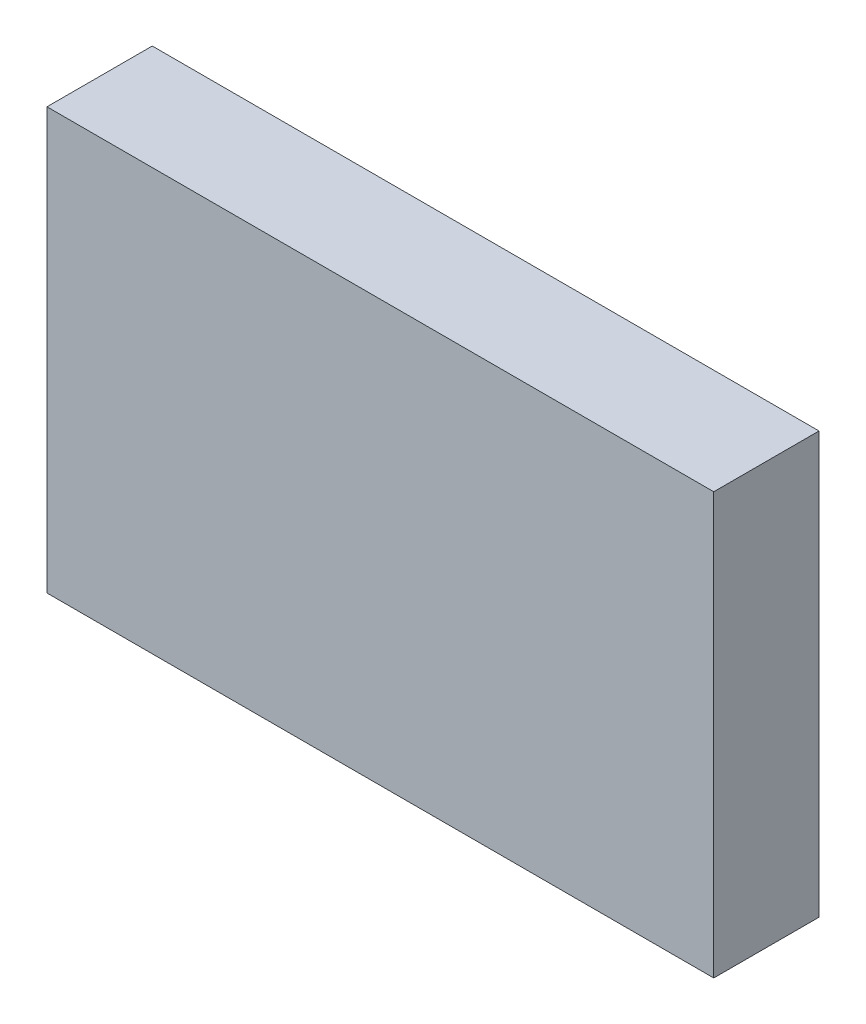
ISO-10303-21;
HEADER;
FILE_DESCRIPTION(('STEP AP214'),'2;1');
FILE_NAME('part.step','',(''),(''),'','','');
FILE_SCHEMA(('AUTOMOTIVE_DESIGN { 1 0 10303 214 1 1 1 1 }'));
ENDSEC;
DATA;
#1=APPLICATION_CONTEXT('core data for automotive mechanical design processes');
#2=APPLICATION_PROTOCOL_DEFINITION('international standard','automotive_design',2000,#1);
#3=PRODUCT_CONTEXT('',#1,'mechanical');
#4=PRODUCT('Part','Part','',(#3));
#5=PRODUCT_RELATED_PRODUCT_CATEGORY('part','',(#4));
#6=PRODUCT_DEFINITION_FORMATION('','',#4);
#7=PRODUCT_DEFINITION_CONTEXT('part definition',#1,'design');
#8=PRODUCT_DEFINITION('design','',#6,#7);
#9=PRODUCT_DEFINITION_SHAPE('','',#8);
#10=(LENGTH_UNIT() NAMED_UNIT(*) SI_UNIT(.MILLI.,.METRE.));
#11=(NAMED_UNIT(*) PLANE_ANGLE_UNIT() SI_UNIT($,.RADIAN.));
#12=(NAMED_UNIT(*) SI_UNIT($,.STERADIAN.) SOLID_ANGLE_UNIT());
#13=UNCERTAINTY_MEASURE_WITH_UNIT(LENGTH_MEASURE(1.E-05),#10,'distance_accuracy_value','');
#14=(GEOMETRIC_REPRESENTATION_CONTEXT(3) GLOBAL_UNCERTAINTY_ASSIGNED_CONTEXT((#13)) GLOBAL_UNIT_ASSIGNED_CONTEXT((#10,
#11,#12)) REPRESENTATION_CONTEXT('',''));
#15=CARTESIAN_POINT('',(0.,0.,0.));
#16=DIRECTION('',(0.,0.,1.));
#17=DIRECTION('',(1.,0.,0.));
#18=AXIS2_PLACEMENT_3D('',#15,#16,#17);
#19=CARTESIAN_POINT('',(-47.5,-30.,15.));
#20=DIRECTION('',(0.,1.,0.));
#21=DIRECTION('',(0.,0.,1.));
#22=AXIS2_PLACEMENT_3D('',#19,#20,#21);
#23=PLANE('',#22);
#24=DIRECTION('',(1.,0.,0.));
#25=VECTOR('',#24,1.);
#26=CARTESIAN_POINT('',(-47.5,-30.,0.));
#27=LINE('',#26,#25);
#28=CARTESIAN_POINT('',(-47.5,-30.,0.));
#29=VERTEX_POINT('',#28);
#30=CARTESIAN_POINT('',(47.5,-30.,0.));
#31=VERTEX_POINT('',#30);
#32=EDGE_CURVE('E106',#29,#31,#27,.T.);
#33=ORIENTED_EDGE('',*,*,#32,.T.);
#34=DIRECTION('',(0.,0.,-1.));
#35=VECTOR('',#34,1.);
#36=CARTESIAN_POINT('',(47.5,-30.,15.));
#37=LINE('',#36,#35);
#38=CARTESIAN_POINT('',(47.5,-30.,15.));
#39=VERTEX_POINT('',#38);
#40=EDGE_CURVE('E11',#39,#31,#37,.T.);
#41=ORIENTED_EDGE('',*,*,#40,.F.);
#42=DIRECTION('',(1.,0.,0.));
#43=VECTOR('',#42,1.);
#44=CARTESIAN_POINT('',(-47.5,-30.,15.));
#45=LINE('',#44,#43);
#46=CARTESIAN_POINT('',(-47.5,-30.,15.));
#47=VERTEX_POINT('',#46);
#48=EDGE_CURVE('E79',#47,#39,#45,.T.);
#49=ORIENTED_EDGE('',*,*,#48,.F.);
#50=DIRECTION('',(0.,0.,-1.));
#51=VECTOR('',#50,1.);
#52=CARTESIAN_POINT('',(-47.5,-30.,15.));
#53=LINE('',#52,#51);
#54=EDGE_CURVE('E102',#47,#29,#53,.T.);
#55=ORIENTED_EDGE('',*,*,#54,.T.);
#56=EDGE_LOOP('',(#33,#41,#49,#55));
#57=FACE_BOUND('',#56,.T.);
#58=ADVANCED_FACE('F39',(#57),#23,.F.);
#59=CARTESIAN_POINT('',(47.5,30.,15.));
#60=DIRECTION('',(1.,0.,0.));
#61=DIRECTION('',(0.,1.,0.));
#62=AXIS2_PLACEMENT_3D('',#59,#60,#61);
#63=PLANE('',#62);
#64=DIRECTION('',(0.,-1.,0.));
#65=VECTOR('',#64,1.);
#66=CARTESIAN_POINT('',(47.5,30.,0.));
#67=LINE('',#66,#65);
#68=CARTESIAN_POINT('',(47.5,30.,0.));
#69=VERTEX_POINT('',#68);
#70=EDGE_CURVE('E88',#69,#31,#67,.T.);
#71=ORIENTED_EDGE('',*,*,#70,.F.);
#72=DIRECTION('',(0.,0.,-1.));
#73=VECTOR('',#72,1.);
#74=CARTESIAN_POINT('',(47.5,30.,15.));
#75=LINE('',#74,#73);
#76=CARTESIAN_POINT('',(47.5,30.,15.));
#77=VERTEX_POINT('',#76);
#78=EDGE_CURVE('E48',#77,#69,#75,.T.);
#79=ORIENTED_EDGE('',*,*,#78,.F.);
#80=DIRECTION('',(0.,-1.,0.));
#81=VECTOR('',#80,1.);
#82=CARTESIAN_POINT('',(47.5,30.,15.));
#83=LINE('',#82,#81);
#84=EDGE_CURVE('E86',#77,#39,#83,.T.);
#85=ORIENTED_EDGE('',*,*,#84,.T.);
#86=ORIENTED_EDGE('',*,*,#40,.T.);
#87=EDGE_LOOP('',(#71,#79,#85,#86));
#88=FACE_BOUND('',#87,.T.);
#89=ADVANCED_FACE('F85',(#88),#63,.T.);
#90=CARTESIAN_POINT('',(-47.5,30.,15.));
#91=DIRECTION('',(0.,1.,0.));
#92=DIRECTION('',(0.,0.,1.));
#93=AXIS2_PLACEMENT_3D('',#90,#91,#92);
#94=PLANE('',#93);
#95=DIRECTION('',(1.,0.,0.));
#96=VECTOR('',#95,1.);
#97=CARTESIAN_POINT('',(-47.5,30.,0.));
#98=LINE('',#97,#96);
#99=CARTESIAN_POINT('',(-47.5,30.,0.));
#100=VERTEX_POINT('',#99);
#101=EDGE_CURVE('E112',#100,#69,#98,.T.);
#102=ORIENTED_EDGE('',*,*,#101,.F.);
#103=DIRECTION('',(0.,0.,-1.));
#104=VECTOR('',#103,1.);
#105=CARTESIAN_POINT('',(-47.5,30.,15.));
#106=LINE('',#105,#104);
#107=CARTESIAN_POINT('',(-47.5,30.,15.));
#108=VERTEX_POINT('',#107);
#109=EDGE_CURVE('E71',#108,#100,#106,.T.);
#110=ORIENTED_EDGE('',*,*,#109,.F.);
#111=DIRECTION('',(1.,0.,0.));
#112=VECTOR('',#111,1.);
#113=CARTESIAN_POINT('',(-47.5,30.,15.));
#114=LINE('',#113,#112);
#115=EDGE_CURVE('E95',#108,#77,#114,.T.);
#116=ORIENTED_EDGE('',*,*,#115,.T.);
#117=ORIENTED_EDGE('',*,*,#78,.T.);
#118=EDGE_LOOP('',(#102,#110,#116,#117));
#119=FACE_BOUND('',#118,.T.);
#120=ADVANCED_FACE('F98',(#119),#94,.T.);
#121=CARTESIAN_POINT('',(-47.5,30.,15.));
#122=DIRECTION('',(1.,0.,0.));
#123=DIRECTION('',(0.,1.,0.));
#124=AXIS2_PLACEMENT_3D('',#121,#122,#123);
#125=PLANE('',#124);
#126=DIRECTION('',(0.,-1.,0.));
#127=VECTOR('',#126,1.);
#128=CARTESIAN_POINT('',(-47.5,30.,0.));
#129=LINE('',#128,#127);
#130=EDGE_CURVE('E74',#100,#29,#129,.T.);
#131=ORIENTED_EDGE('',*,*,#130,.T.);
#132=ORIENTED_EDGE('',*,*,#54,.F.);
#133=DIRECTION('',(0.,-1.,0.));
#134=VECTOR('',#133,1.);
#135=CARTESIAN_POINT('',(-47.5,30.,15.));
#136=LINE('',#135,#134);
#137=EDGE_CURVE('E56',#108,#47,#136,.T.);
#138=ORIENTED_EDGE('',*,*,#137,.F.);
#139=ORIENTED_EDGE('',*,*,#109,.T.);
#140=EDGE_LOOP('',(#131,#132,#138,#139));
#141=FACE_BOUND('',#140,.T.);
#142=ADVANCED_FACE('F129',(#141),#125,.F.);
#143=CARTESIAN_POINT('',(0.,0.,15.));
#144=DIRECTION('',(0.,0.,-1.));
#145=DIRECTION('',(-1.,0.,0.));
#146=AXIS2_PLACEMENT_3D('',#143,#144,#145);
#147=PLANE('',#146);
#148=ORIENTED_EDGE('',*,*,#48,.T.);
#149=ORIENTED_EDGE('',*,*,#84,.F.);
#150=ORIENTED_EDGE('',*,*,#115,.F.);
#151=ORIENTED_EDGE('',*,*,#137,.T.);
#152=EDGE_LOOP('',(#148,#149,#150,#151));
#153=FACE_BOUND('',#152,.T.);
#154=ADVANCED_FACE('F94',(#153),#147,.F.);
#155=CARTESIAN_POINT('',(0.,0.,0.));
#156=DIRECTION('',(0.,0.,-1.));
#157=DIRECTION('',(-1.,0.,0.));
#158=AXIS2_PLACEMENT_3D('',#155,#156,#157);
#159=PLANE('',#158);
#160=ORIENTED_EDGE('',*,*,#32,.F.);
#161=ORIENTED_EDGE('',*,*,#130,.F.);
#162=ORIENTED_EDGE('',*,*,#101,.T.);
#163=ORIENTED_EDGE('',*,*,#70,.T.);
#164=EDGE_LOOP('',(#160,#161,#162,#163));
#165=FACE_BOUND('',#164,.T.);
#166=ADVANCED_FACE('F123',(#165),#159,.T.);
#167=CLOSED_SHELL('',(#58,#89,#120,#142,#154,#166));
#168=MANIFOLD_SOLID_BREP('B2',#167);
#169=ADVANCED_BREP_SHAPE_REPRESENTATION('',(#18,#168),#14);
#170=SHAPE_DEFINITION_REPRESENTATION(#9,#169);
ENDSEC;
END-ISO-10303-21;
